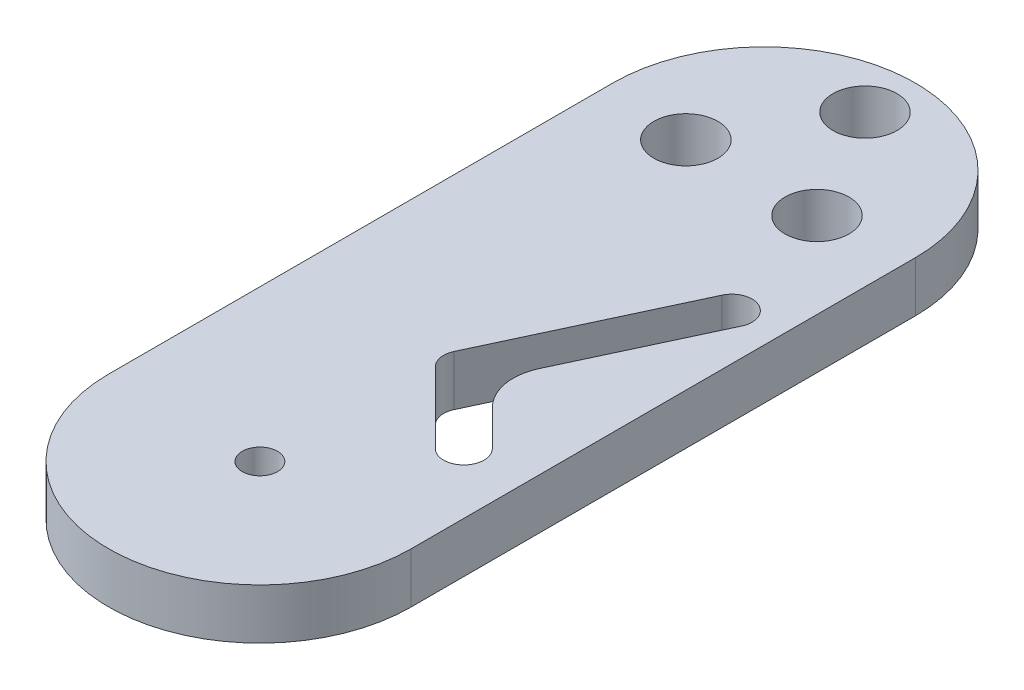
ISO-10303-21;
HEADER;
FILE_DESCRIPTION(('STEP AP214'),'2;1');
FILE_NAME('part.step','',(''),(''),'','','');
FILE_SCHEMA(('AUTOMOTIVE_DESIGN { 1 0 10303 214 1 1 1 1 }'));
ENDSEC;
DATA;
#1=APPLICATION_CONTEXT('core data for automotive mechanical design processes');
#2=APPLICATION_PROTOCOL_DEFINITION('international standard','automotive_design',2000,#1);
#3=PRODUCT_CONTEXT('',#1,'mechanical');
#4=PRODUCT('Part','Part','',(#3));
#5=PRODUCT_RELATED_PRODUCT_CATEGORY('part','',(#4));
#6=PRODUCT_DEFINITION_FORMATION('','',#4);
#7=PRODUCT_DEFINITION_CONTEXT('part definition',#1,'design');
#8=PRODUCT_DEFINITION('design','',#6,#7);
#9=PRODUCT_DEFINITION_SHAPE('','',#8);
#10=(LENGTH_UNIT() NAMED_UNIT(*) SI_UNIT(.MILLI.,.METRE.));
#11=(NAMED_UNIT(*) PLANE_ANGLE_UNIT() SI_UNIT($,.RADIAN.));
#12=(NAMED_UNIT(*) SI_UNIT($,.STERADIAN.) SOLID_ANGLE_UNIT());
#13=UNCERTAINTY_MEASURE_WITH_UNIT(LENGTH_MEASURE(1.E-05),#10,'distance_accuracy_value','');
#14=(GEOMETRIC_REPRESENTATION_CONTEXT(3) GLOBAL_UNCERTAINTY_ASSIGNED_CONTEXT((#13)) GLOBAL_UNIT_ASSIGNED_CONTEXT((#10,
#11,#12)) REPRESENTATION_CONTEXT('',''));
#15=CARTESIAN_POINT('',(0.,0.,0.));
#16=DIRECTION('',(0.,0.,1.));
#17=DIRECTION('',(1.,0.,0.));
#18=AXIS2_PLACEMENT_3D('',#15,#16,#17);
#19=CARTESIAN_POINT('',(15.,5.,0.));
#20=DIRECTION('',(-1.,0.,0.));
#21=DIRECTION('',(0.,0.,1.));
#22=AXIS2_PLACEMENT_3D('',#19,#20,#21);
#23=PLANE('',#22);
#24=DIRECTION('',(0.,0.,-1.));
#25=VECTOR('',#24,1.);
#26=CARTESIAN_POINT('',(15.,0.,0.));
#27=LINE('',#26,#25);
#28=CARTESIAN_POINT('',(15.,0.,0.));
#29=VERTEX_POINT('',#28);
#30=CARTESIAN_POINT('',(15.,0.,-50.));
#31=VERTEX_POINT('',#30);
#32=EDGE_CURVE('E249',#29,#31,#27,.T.);
#33=ORIENTED_EDGE('',*,*,#32,.T.);
#34=DIRECTION('',(0.,-1.,0.));
#35=VECTOR('',#34,1.);
#36=CARTESIAN_POINT('',(15.,5.,-50.));
#37=LINE('',#36,#35);
#38=CARTESIAN_POINT('',(15.,5.,-50.));
#39=VERTEX_POINT('',#38);
#40=EDGE_CURVE('E272',#39,#31,#37,.T.);
#41=ORIENTED_EDGE('',*,*,#40,.F.);
#42=DIRECTION('',(0.,0.,-1.));
#43=VECTOR('',#42,1.);
#44=CARTESIAN_POINT('',(15.,5.,0.));
#45=LINE('',#44,#43);
#46=CARTESIAN_POINT('',(15.,5.,0.));
#47=VERTEX_POINT('',#46);
#48=EDGE_CURVE('E195',#47,#39,#45,.T.);
#49=ORIENTED_EDGE('',*,*,#48,.F.);
#50=DIRECTION('',(0.,-1.,0.));
#51=VECTOR('',#50,1.);
#52=CARTESIAN_POINT('',(15.,5.,0.));
#53=LINE('',#52,#51);
#54=EDGE_CURVE('E143',#47,#29,#53,.T.);
#55=ORIENTED_EDGE('',*,*,#54,.T.);
#56=EDGE_LOOP('',(#33,#41,#49,#55));
#57=FACE_BOUND('',#56,.T.);
#58=ADVANCED_FACE('F41',(#57),#23,.F.);
#59=CARTESIAN_POINT('',(0.,5.,-50.));
#60=DIRECTION('',(0.,-1.,0.));
#61=DIRECTION('',(0.,0.,-1.));
#62=AXIS2_PLACEMENT_3D('',#59,#60,#61);
#63=CYLINDRICAL_SURFACE('',#62,15.);
#64=CARTESIAN_POINT('',(0.,0.,-50.));
#65=DIRECTION('',(0.,1.,0.));
#66=DIRECTION('',(0.,0.,1.));
#67=AXIS2_PLACEMENT_3D('',#64,#65,#66);
#68=CIRCLE('',#67,15.);
#69=CARTESIAN_POINT('',(-15.,0.,-50.));
#70=VERTEX_POINT('',#69);
#71=EDGE_CURVE('E253',#31,#70,#68,.T.);
#72=ORIENTED_EDGE('',*,*,#71,.T.);
#73=DIRECTION('',(0.,-1.,0.));
#74=VECTOR('',#73,1.);
#75=CARTESIAN_POINT('',(-15.,5.,-50.));
#76=LINE('',#75,#74);
#77=CARTESIAN_POINT('',(-15.,5.,-50.));
#78=VERTEX_POINT('',#77);
#79=EDGE_CURVE('E269',#78,#70,#76,.T.);
#80=ORIENTED_EDGE('',*,*,#79,.F.);
#81=CARTESIAN_POINT('',(0.,5.,-50.));
#82=DIRECTION('',(0.,1.,0.));
#83=DIRECTION('',(0.,0.,1.));
#84=AXIS2_PLACEMENT_3D('',#81,#82,#83);
#85=CIRCLE('',#84,15.);
#86=EDGE_CURVE('E199',#39,#78,#85,.T.);
#87=ORIENTED_EDGE('',*,*,#86,.F.);
#88=ORIENTED_EDGE('',*,*,#40,.T.);
#89=EDGE_LOOP('',(#72,#80,#87,#88));
#90=FACE_BOUND('',#89,.T.);
#91=ADVANCED_FACE('F319',(#90),#63,.T.);
#92=CARTESIAN_POINT('',(-15.,5.,0.));
#93=DIRECTION('',(-1.,0.,0.));
#94=DIRECTION('',(0.,0.,1.));
#95=AXIS2_PLACEMENT_3D('',#92,#93,#94);
#96=PLANE('',#95);
#97=DIRECTION('',(0.,0.,-1.));
#98=VECTOR('',#97,1.);
#99=CARTESIAN_POINT('',(-15.,0.,0.));
#100=LINE('',#99,#98);
#101=CARTESIAN_POINT('',(-15.,0.,0.));
#102=VERTEX_POINT('',#101);
#103=EDGE_CURVE('E257',#102,#70,#100,.T.);
#104=ORIENTED_EDGE('',*,*,#103,.F.);
#105=DIRECTION('',(0.,-1.,0.));
#106=VECTOR('',#105,1.);
#107=CARTESIAN_POINT('',(-15.,5.,0.));
#108=LINE('',#107,#106);
#109=CARTESIAN_POINT('',(-15.,5.,0.));
#110=VERTEX_POINT('',#109);
#111=EDGE_CURVE('E266',#110,#102,#108,.T.);
#112=ORIENTED_EDGE('',*,*,#111,.F.);
#113=DIRECTION('',(0.,0.,-1.));
#114=VECTOR('',#113,1.);
#115=CARTESIAN_POINT('',(-15.,5.,0.));
#116=LINE('',#115,#114);
#117=EDGE_CURVE('E202',#110,#78,#116,.T.);
#118=ORIENTED_EDGE('',*,*,#117,.T.);
#119=ORIENTED_EDGE('',*,*,#79,.T.);
#120=EDGE_LOOP('',(#104,#112,#118,#119));
#121=FACE_BOUND('',#120,.T.);
#122=ADVANCED_FACE('F325',(#121),#96,.T.);
#123=CARTESIAN_POINT('',(9.,5.,-11.2213322873401));
#124=DIRECTION('',(0.,-1.,0.));
#125=DIRECTION('',(0.,0.,-1.));
#126=AXIS2_PLACEMENT_3D('',#123,#124,#125);
#127=CYLINDRICAL_SURFACE('',#126,2.);
#128=CARTESIAN_POINT('',(9.,0.,-11.2213322873401));
#129=DIRECTION('',(0.,1.,0.));
#130=DIRECTION('',(0.,0.,1.));
#131=AXIS2_PLACEMENT_3D('',#128,#129,#130);
#132=CIRCLE('',#131,2.);
#133=CARTESIAN_POINT('',(7.58578643762691,0.,-9.80711872496699));
#134=VERTEX_POINT('',#133);
#135=CARTESIAN_POINT('',(10.4142135623731,0.,-12.6355458497132));
#136=VERTEX_POINT('',#135);
#137=EDGE_CURVE('E137',#134,#136,#132,.T.);
#138=ORIENTED_EDGE('',*,*,#137,.F.);
#139=DIRECTION('',(0.,-1.,0.));
#140=VECTOR('',#139,1.);
#141=CARTESIAN_POINT('',(7.58578643762691,5.,-9.80711872496699));
#142=LINE('',#141,#140);
#143=CARTESIAN_POINT('',(7.58578643762691,5.,-9.80711872496699));
#144=VERTEX_POINT('',#143);
#145=EDGE_CURVE('E131',#144,#134,#142,.T.);
#146=ORIENTED_EDGE('',*,*,#145,.F.);
#147=CARTESIAN_POINT('',(9.,5.,-11.2213322873401));
#148=DIRECTION('',(0.,1.,0.));
#149=DIRECTION('',(0.,0.,1.));
#150=AXIS2_PLACEMENT_3D('',#147,#148,#149);
#151=CIRCLE('',#150,2.);
#152=CARTESIAN_POINT('',(10.4142135623731,5.,-12.6355458497132));
#153=VERTEX_POINT('',#152);
#154=EDGE_CURVE('E135',#144,#153,#151,.T.);
#155=ORIENTED_EDGE('',*,*,#154,.T.);
#156=DIRECTION('',(0.,-1.,0.));
#157=VECTOR('',#156,1.);
#158=CARTESIAN_POINT('',(10.4142135623731,5.,-12.6355458497132));
#159=LINE('',#158,#157);
#160=EDGE_CURVE('E209',#153,#136,#159,.T.);
#161=ORIENTED_EDGE('',*,*,#160,.T.);
#162=EDGE_LOOP('',(#138,#146,#155,#161));
#163=FACE_BOUND('',#162,.T.);
#164=ADVANCED_FACE('F133',(#163),#127,.F.);
#165=CARTESIAN_POINT('',(8.69645258129688,5.,-8.69645258129705));
#166=DIRECTION('',(0.707106781186541,0.,-0.707106781186555));
#167=DIRECTION('',(-0.707106781186555,0.,-0.707106781186541));
#168=AXIS2_PLACEMENT_3D('',#165,#166,#167);
#169=PLANE('',#168);
#170=DIRECTION('',(0.707106781186555,0.,0.707106781186541));
#171=VECTOR('',#170,1.);
#172=CARTESIAN_POINT('',(8.69645258129688,0.,-8.69645258129705));
#173=LINE('',#172,#171);
#174=CARTESIAN_POINT('',(0.578536078837901,0.,-16.8143690837559));
#175=VERTEX_POINT('',#174);
#176=EDGE_CURVE('E212',#175,#134,#173,.T.);
#177=ORIENTED_EDGE('',*,*,#176,.F.);
#178=DIRECTION('',(0.,-1.,0.));
#179=VECTOR('',#178,1.);
#180=CARTESIAN_POINT('',(0.578536078837901,5.,-16.8143690837559));
#181=LINE('',#180,#179);
#182=CARTESIAN_POINT('',(0.578536078837901,5.,-16.8143690837559));
#183=VERTEX_POINT('',#182);
#184=EDGE_CURVE('E144',#183,#175,#181,.T.);
#185=ORIENTED_EDGE('',*,*,#184,.F.);
#186=DIRECTION('',(0.707106781186555,0.,0.707106781186541));
#187=VECTOR('',#186,1.);
#188=CARTESIAN_POINT('',(8.69645258129688,5.,-8.69645258129705));
#189=LINE('',#188,#187);
#190=EDGE_CURVE('E151',#183,#144,#189,.T.);
#191=ORIENTED_EDGE('',*,*,#190,.T.);
#192=ORIENTED_EDGE('',*,*,#145,.T.);
#193=EDGE_LOOP('',(#177,#185,#191,#192));
#194=FACE_BOUND('',#193,.T.);
#195=ADVANCED_FACE('F159',(#194),#169,.T.);
#196=CARTESIAN_POINT('',(1.99274964121098,5.,-18.228582646129));
#197=DIRECTION('',(0.,-1.,0.));
#198=DIRECTION('',(0.,0.,-1.));
#199=AXIS2_PLACEMENT_3D('',#196,#197,#198);
#200=CYLINDRICAL_SURFACE('',#199,2.);
#201=CARTESIAN_POINT('',(1.99274964121098,0.,-18.228582646129));
#202=DIRECTION('',(0.,1.,0.));
#203=DIRECTION('',(0.,0.,1.));
#204=AXIS2_PLACEMENT_3D('',#201,#202,#203);
#205=CIRCLE('',#204,2.);
#206=CARTESIAN_POINT('',(0.180134067137676,0.,-19.0738191696104));
#207=VERTEX_POINT('',#206);
#208=EDGE_CURVE('E215',#207,#175,#205,.T.);
#209=ORIENTED_EDGE('',*,*,#208,.F.);
#210=DIRECTION('',(0.,-1.,0.));
#211=VECTOR('',#210,1.);
#212=CARTESIAN_POINT('',(0.180134067137676,5.,-19.0738191696104));
#213=LINE('',#212,#211);
#214=CARTESIAN_POINT('',(0.180134067137676,5.,-19.0738191696104));
#215=VERTEX_POINT('',#214);
#216=EDGE_CURVE('E285',#215,#207,#213,.T.);
#217=ORIENTED_EDGE('',*,*,#216,.F.);
#218=CARTESIAN_POINT('',(1.99274964121098,5.,-18.228582646129));
#219=DIRECTION('',(0.,1.,0.));
#220=DIRECTION('',(0.,0.,1.));
#221=AXIS2_PLACEMENT_3D('',#218,#219,#220);
#222=CIRCLE('',#221,2.);
#223=EDGE_CURVE('E161',#215,#183,#222,.T.);
#224=ORIENTED_EDGE('',*,*,#223,.T.);
#225=ORIENTED_EDGE('',*,*,#184,.T.);
#226=EDGE_LOOP('',(#209,#217,#224,#225));
#227=FACE_BOUND('',#226,.T.);
#228=ADVANCED_FACE('F305',(#227),#200,.F.);
#229=CARTESIAN_POINT('',(-7.15773558517994,5.,-3.3377069184179));
#230=DIRECTION('',(0.906307787036653,0.,0.422618261740694));
#231=DIRECTION('',(0.422618261740694,0.,-0.906307787036653));
#232=AXIS2_PLACEMENT_3D('',#229,#230,#231);
#233=PLANE('',#232);
#234=DIRECTION('',(-0.422618261740694,0.,0.906307787036653));
#235=VECTOR('',#234,1.);
#236=CARTESIAN_POINT('',(-7.15773558517994,0.,-3.3377069184179));
#237=LINE('',#236,#235);
#238=CARTESIAN_POINT('',(8.63249930195154,0.,-37.1999749103434));
#239=VERTEX_POINT('',#238);
#240=EDGE_CURVE('E219',#239,#207,#237,.T.);
#241=ORIENTED_EDGE('',*,*,#240,.F.);
#242=DIRECTION('',(0.,-1.,0.));
#243=VECTOR('',#242,1.);
#244=CARTESIAN_POINT('',(8.63249930195154,5.,-37.1999749103434));
#245=LINE('',#244,#243);
#246=CARTESIAN_POINT('',(8.63249930195154,5.,-37.1999749103434));
#247=VERTEX_POINT('',#246);
#248=EDGE_CURVE('E282',#247,#239,#245,.T.);
#249=ORIENTED_EDGE('',*,*,#248,.F.);
#250=DIRECTION('',(-0.422618261740694,0.,0.906307787036653));
#251=VECTOR('',#250,1.);
#252=CARTESIAN_POINT('',(-7.15773558517994,5.,-3.3377069184179));
#253=LINE('',#252,#251);
#254=EDGE_CURVE('E164',#247,#215,#253,.T.);
#255=ORIENTED_EDGE('',*,*,#254,.T.);
#256=ORIENTED_EDGE('',*,*,#216,.T.);
#257=EDGE_LOOP('',(#241,#249,#255,#256));
#258=FACE_BOUND('',#257,.T.);
#259=ADVANCED_FACE('F309',(#258),#233,.T.);
#260=CARTESIAN_POINT('',(10.4451148760249,5.,-36.354738386862));
#261=DIRECTION('',(0.,-1.,0.));
#262=DIRECTION('',(0.,0.,-1.));
#263=AXIS2_PLACEMENT_3D('',#260,#261,#262);
#264=CYLINDRICAL_SURFACE('',#263,2.);
#265=CARTESIAN_POINT('',(10.4451148760249,0.,-36.354738386862));
#266=DIRECTION('',(0.,1.,0.));
#267=DIRECTION('',(0.,0.,1.));
#268=AXIS2_PLACEMENT_3D('',#265,#266,#267);
#269=CIRCLE('',#268,2.);
#270=CARTESIAN_POINT('',(12.2577304500982,0.,-35.5095018633806));
#271=VERTEX_POINT('',#270);
#272=EDGE_CURVE('E223',#271,#239,#269,.T.);
#273=ORIENTED_EDGE('',*,*,#272,.F.);
#274=DIRECTION('',(0.,-1.,0.));
#275=VECTOR('',#274,1.);
#276=CARTESIAN_POINT('',(12.2577304500982,5.,-35.5095018633806));
#277=LINE('',#276,#275);
#278=CARTESIAN_POINT('',(12.2577304500982,5.,-35.5095018633806));
#279=VERTEX_POINT('',#278);
#280=EDGE_CURVE('E279',#279,#271,#277,.T.);
#281=ORIENTED_EDGE('',*,*,#280,.F.);
#282=CARTESIAN_POINT('',(10.4451148760249,5.,-36.354738386862));
#283=DIRECTION('',(0.,1.,0.));
#284=DIRECTION('',(0.,0.,1.));
#285=AXIS2_PLACEMENT_3D('',#282,#283,#284);
#286=CIRCLE('',#285,2.);
#287=EDGE_CURVE('E170',#279,#247,#286,.T.);
#288=ORIENTED_EDGE('',*,*,#287,.T.);
#289=ORIENTED_EDGE('',*,*,#248,.T.);
#290=EDGE_LOOP('',(#273,#281,#288,#289));
#291=FACE_BOUND('',#290,.T.);
#292=ADVANCED_FACE('F312',(#291),#264,.F.);
#293=CARTESIAN_POINT('',(-3.53250443703333,5.,-1.64723387145512));
#294=DIRECTION('',(0.906307787036653,0.,0.422618261740694));
#295=DIRECTION('',(0.422618261740694,0.,-0.906307787036653));
#296=AXIS2_PLACEMENT_3D('',#293,#294,#295);
#297=PLANE('',#296);
#298=DIRECTION('',(-0.422618261740694,0.,0.906307787036653));
#299=VECTOR('',#298,1.);
#300=CARTESIAN_POINT('',(-3.53250443703333,0.,-1.64723387145512));
#301=LINE('',#300,#299);
#302=CARTESIAN_POINT('',(5.87680866387572,0.,-21.8255709335962));
#303=VERTEX_POINT('',#302);
#304=EDGE_CURVE('E227',#271,#303,#301,.T.);
#305=ORIENTED_EDGE('',*,*,#304,.T.);
#306=DIRECTION('',(0.,-1.,0.));
#307=VECTOR('',#306,1.);
#308=CARTESIAN_POINT('',(5.87680866387572,5.,-21.8255709335962));
#309=LINE('',#308,#307);
#310=CARTESIAN_POINT('',(5.87680866387572,5.,-21.8255709335962));
#311=VERTEX_POINT('',#310);
#312=EDGE_CURVE('E50',#303,#311,#309,.F.);
#313=ORIENTED_EDGE('',*,*,#312,.T.);
#314=DIRECTION('',(-0.422618261740694,0.,0.906307787036653));
#315=VECTOR('',#314,1.);
#316=CARTESIAN_POINT('',(-3.53250443703333,5.,-1.64723387145512));
#317=LINE('',#316,#315);
#318=EDGE_CURVE('E174',#279,#311,#317,.T.);
#319=ORIENTED_EDGE('',*,*,#318,.F.);
#320=ORIENTED_EDGE('',*,*,#280,.T.);
#321=EDGE_LOOP('',(#305,#313,#319,#320));
#322=FACE_BOUND('',#321,.T.);
#323=ADVANCED_FACE('F334',(#322),#297,.F.);
#324=CARTESIAN_POINT('',(0.,5.,0.));
#325=DIRECTION('',(0.,-1.,0.));
#326=DIRECTION('',(0.,0.,-1.));
#327=AXIS2_PLACEMENT_3D('',#324,#325,#326);
#328=CYLINDRICAL_SURFACE('',#327,1.75);
#329=CARTESIAN_POINT('',(0.,5.,0.));
#330=DIRECTION('',(0.,1.,0.));
#331=DIRECTION('',(0.,0.,1.));
#332=AXIS2_PLACEMENT_3D('',#329,#330,#331);
#333=CIRCLE('',#332,1.75);
#334=CARTESIAN_POINT('',(0.,5.,1.75));
#335=VERTEX_POINT('',#334);
#336=EDGE_CURVE('E191',#335,#335,#333,.T.);
#337=ORIENTED_EDGE('',*,*,#336,.T.);
#338=EDGE_LOOP('',(#337));
#339=FACE_BOUND('',#338,.T.);
#340=CARTESIAN_POINT('',(0.,0.,0.));
#341=DIRECTION('',(0.,1.,0.));
#342=DIRECTION('',(0.,0.,1.));
#343=AXIS2_PLACEMENT_3D('',#340,#341,#342);
#344=CIRCLE('',#343,1.75);
#345=CARTESIAN_POINT('',(0.,0.,1.75));
#346=VERTEX_POINT('',#345);
#347=EDGE_CURVE('E245',#346,#346,#344,.T.);
#348=ORIENTED_EDGE('',*,*,#347,.F.);
#349=EDGE_LOOP('',(#348));
#350=FACE_BOUND('',#349,.T.);
#351=ADVANCED_FACE('F330',(#339,#350),#328,.F.);
#352=CARTESIAN_POINT('',(0.,5.,-60.));
#353=DIRECTION('',(0.,-1.,0.));
#354=DIRECTION('',(0.,0.,-1.));
#355=AXIS2_PLACEMENT_3D('',#352,#353,#354);
#356=CYLINDRICAL_SURFACE('',#355,3.175);
#357=CARTESIAN_POINT('',(0.,5.,-60.));
#358=DIRECTION('',(0.,1.,0.));
#359=DIRECTION('',(0.,0.,1.));
#360=AXIS2_PLACEMENT_3D('',#357,#358,#359);
#361=CIRCLE('',#360,3.175);
#362=CARTESIAN_POINT('',(0.,5.,-56.825));
#363=VERTEX_POINT('',#362);
#364=EDGE_CURVE('E187',#363,#363,#361,.T.);
#365=ORIENTED_EDGE('',*,*,#364,.T.);
#366=EDGE_LOOP('',(#365));
#367=FACE_BOUND('',#366,.T.);
#368=CARTESIAN_POINT('',(0.,0.,-60.));
#369=DIRECTION('',(0.,1.,0.));
#370=DIRECTION('',(0.,0.,1.));
#371=AXIS2_PLACEMENT_3D('',#368,#369,#370);
#372=CIRCLE('',#371,3.175);
#373=CARTESIAN_POINT('',(0.,0.,-56.825));
#374=VERTEX_POINT('',#373);
#375=EDGE_CURVE('E241',#374,#374,#372,.T.);
#376=ORIENTED_EDGE('',*,*,#375,.F.);
#377=EDGE_LOOP('',(#376));
#378=FACE_BOUND('',#377,.T.);
#379=ADVANCED_FACE('F333',(#367,#378),#356,.F.);
#380=CARTESIAN_POINT('',(-6.5,5.,-48.7416697508023));
#381=DIRECTION('',(0.,-1.,0.));
#382=DIRECTION('',(0.,0.,-1.));
#383=AXIS2_PLACEMENT_3D('',#380,#381,#382);
#384=CYLINDRICAL_SURFACE('',#383,3.175);
#385=CARTESIAN_POINT('',(-6.5,5.,-48.7416697508023));
#386=DIRECTION('',(0.,1.,0.));
#387=DIRECTION('',(0.,0.,1.));
#388=AXIS2_PLACEMENT_3D('',#385,#386,#387);
#389=CIRCLE('',#388,3.175);
#390=CARTESIAN_POINT('',(-6.5,5.,-45.5666697508023));
#391=VERTEX_POINT('',#390);
#392=EDGE_CURVE('E183',#391,#391,#389,.T.);
#393=ORIENTED_EDGE('',*,*,#392,.T.);
#394=EDGE_LOOP('',(#393));
#395=FACE_BOUND('',#394,.T.);
#396=CARTESIAN_POINT('',(-6.5,0.,-48.7416697508023));
#397=DIRECTION('',(0.,1.,0.));
#398=DIRECTION('',(0.,0.,1.));
#399=AXIS2_PLACEMENT_3D('',#396,#397,#398);
#400=CIRCLE('',#399,3.175);
#401=CARTESIAN_POINT('',(-6.5,0.,-45.5666697508023));
#402=VERTEX_POINT('',#401);
#403=EDGE_CURVE('E237',#402,#402,#400,.T.);
#404=ORIENTED_EDGE('',*,*,#403,.F.);
#405=EDGE_LOOP('',(#404));
#406=FACE_BOUND('',#405,.T.);
#407=ADVANCED_FACE('F338',(#395,#406),#384,.F.);
#408=CARTESIAN_POINT('',(6.5,5.,-48.7416697508023));
#409=DIRECTION('',(0.,-1.,0.));
#410=DIRECTION('',(0.,0.,-1.));
#411=AXIS2_PLACEMENT_3D('',#408,#409,#410);
#412=CYLINDRICAL_SURFACE('',#411,3.175);
#413=CARTESIAN_POINT('',(6.5,5.,-48.7416697508023));
#414=DIRECTION('',(0.,1.,0.));
#415=DIRECTION('',(0.,0.,1.));
#416=AXIS2_PLACEMENT_3D('',#413,#414,#415);
#417=CIRCLE('',#416,3.175);
#418=CARTESIAN_POINT('',(6.5,5.,-45.5666697508023));
#419=VERTEX_POINT('',#418);
#420=EDGE_CURVE('E179',#419,#419,#417,.T.);
#421=ORIENTED_EDGE('',*,*,#420,.T.);
#422=EDGE_LOOP('',(#421));
#423=FACE_BOUND('',#422,.T.);
#424=CARTESIAN_POINT('',(6.5,0.,-48.7416697508023));
#425=DIRECTION('',(0.,1.,0.));
#426=DIRECTION('',(0.,0.,1.));
#427=AXIS2_PLACEMENT_3D('',#424,#425,#426);
#428=CIRCLE('',#427,3.175);
#429=CARTESIAN_POINT('',(6.5,0.,-45.5666697508023));
#430=VERTEX_POINT('',#429);
#431=EDGE_CURVE('E233',#430,#430,#428,.T.);
#432=ORIENTED_EDGE('',*,*,#431,.F.);
#433=EDGE_LOOP('',(#432));
#434=FACE_BOUND('',#433,.T.);
#435=ADVANCED_FACE('F342',(#423,#434),#412,.F.);
#436=CARTESIAN_POINT('',(11.524879706043,5.,-11.5248797060433));
#437=DIRECTION('',(0.707106781186541,0.,-0.707106781186554));
#438=DIRECTION('',(-0.707106781186554,0.,-0.707106781186541));
#439=AXIS2_PLACEMENT_3D('',#436,#437,#438);
#440=PLANE('',#439);
#441=DIRECTION('',(0.707106781186554,0.,0.707106781186541));
#442=VECTOR('',#441,1.);
#443=CARTESIAN_POINT('',(11.524879706043,5.,-11.5248797060433));
#444=LINE('',#443,#442);
#445=CARTESIAN_POINT('',(6.87281369312628,5.,-16.1769457189599));
#446=VERTEX_POINT('',#445);
#447=EDGE_CURVE('E154',#446,#153,#444,.T.);
#448=ORIENTED_EDGE('',*,*,#447,.F.);
#449=DIRECTION('',(0.,-1.,0.));
#450=VECTOR('',#449,1.);
#451=CARTESIAN_POINT('',(6.87281369312628,5.,-16.1769457189599));
#452=LINE('',#451,#450);
#453=CARTESIAN_POINT('',(6.87281369312628,0.,-16.1769457189599));
#454=VERTEX_POINT('',#453);
#455=EDGE_CURVE('E276',#446,#454,#452,.T.);
#456=ORIENTED_EDGE('',*,*,#455,.T.);
#457=DIRECTION('',(0.707106781186554,0.,0.707106781186541));
#458=VECTOR('',#457,1.);
#459=CARTESIAN_POINT('',(11.524879706043,0.,-11.5248797060433));
#460=LINE('',#459,#458);
#461=EDGE_CURVE('E230',#454,#136,#460,.T.);
#462=ORIENTED_EDGE('',*,*,#461,.T.);
#463=ORIENTED_EDGE('',*,*,#160,.F.);
#464=EDGE_LOOP('',(#448,#456,#462,#463));
#465=FACE_BOUND('',#464,.T.);
#466=ADVANCED_FACE('F297',(#465),#440,.F.);
#467=CARTESIAN_POINT('',(0.,5.,0.));
#468=DIRECTION('',(0.,-1.,0.));
#469=DIRECTION('',(0.,0.,-1.));
#470=AXIS2_PLACEMENT_3D('',#467,#468,#469);
#471=CYLINDRICAL_SURFACE('',#470,15.);
#472=CARTESIAN_POINT('',(0.,0.,0.));
#473=DIRECTION('',(0.,1.,0.));
#474=DIRECTION('',(0.,0.,1.));
#475=AXIS2_PLACEMENT_3D('',#472,#473,#474);
#476=CIRCLE('',#475,15.);
#477=EDGE_CURVE('E157',#102,#29,#476,.T.);
#478=ORIENTED_EDGE('',*,*,#477,.T.);
#479=ORIENTED_EDGE('',*,*,#54,.F.);
#480=CARTESIAN_POINT('',(0.,5.,0.));
#481=DIRECTION('',(0.,1.,0.));
#482=DIRECTION('',(0.,0.,1.));
#483=AXIS2_PLACEMENT_3D('',#480,#481,#482);
#484=CIRCLE('',#483,15.);
#485=EDGE_CURVE('E206',#110,#47,#484,.T.);
#486=ORIENTED_EDGE('',*,*,#485,.F.);
#487=ORIENTED_EDGE('',*,*,#111,.T.);
#488=EDGE_LOOP('',(#478,#479,#486,#487));
#489=FACE_BOUND('',#488,.T.);
#490=ADVANCED_FACE('F349',(#489),#471,.T.);
#491=CARTESIAN_POINT('',(0.,5.,0.));
#492=DIRECTION('',(0.,1.,0.));
#493=DIRECTION('',(0.,0.,1.));
#494=AXIS2_PLACEMENT_3D('',#491,#492,#493);
#495=PLANE('',#494);
#496=ORIENTED_EDGE('',*,*,#318,.T.);
#497=CARTESIAN_POINT('',(10.408347599059,5.,-19.7124796248927));
#498=DIRECTION('',(0.,1.,0.));
#499=DIRECTION('',(0.,0.,1.));
#500=AXIS2_PLACEMENT_3D('',#497,#498,#499);
#501=CIRCLE('',#500,5.);
#502=EDGE_CURVE('E11',#311,#446,#501,.T.);
#503=ORIENTED_EDGE('',*,*,#502,.T.);
#504=ORIENTED_EDGE('',*,*,#447,.T.);
#505=ORIENTED_EDGE('',*,*,#154,.F.);
#506=ORIENTED_EDGE('',*,*,#190,.F.);
#507=ORIENTED_EDGE('',*,*,#223,.F.);
#508=ORIENTED_EDGE('',*,*,#254,.F.);
#509=ORIENTED_EDGE('',*,*,#287,.F.);
#510=EDGE_LOOP('',(#496,#503,#504,#505,#506,#507,#508,#509));
#511=FACE_BOUND('',#510,.T.);
#512=ORIENTED_EDGE('',*,*,#420,.F.);
#513=EDGE_LOOP('',(#512));
#514=FACE_BOUND('',#513,.T.);
#515=ORIENTED_EDGE('',*,*,#392,.F.);
#516=EDGE_LOOP('',(#515));
#517=FACE_BOUND('',#516,.T.);
#518=ORIENTED_EDGE('',*,*,#364,.F.);
#519=EDGE_LOOP('',(#518));
#520=FACE_BOUND('',#519,.T.);
#521=ORIENTED_EDGE('',*,*,#336,.F.);
#522=EDGE_LOOP('',(#521));
#523=FACE_BOUND('',#522,.T.);
#524=ORIENTED_EDGE('',*,*,#48,.T.);
#525=ORIENTED_EDGE('',*,*,#86,.T.);
#526=ORIENTED_EDGE('',*,*,#117,.F.);
#527=ORIENTED_EDGE('',*,*,#485,.T.);
#528=EDGE_LOOP('',(#524,#525,#526,#527));
#529=FACE_BOUND('',#528,.T.);
#530=ADVANCED_FACE('F148',(#511,#514,#517,#520,#523,#529),#495,.T.);
#531=CARTESIAN_POINT('',(0.,0.,0.));
#532=DIRECTION('',(0.,1.,0.));
#533=DIRECTION('',(0.,0.,1.));
#534=AXIS2_PLACEMENT_3D('',#531,#532,#533);
#535=PLANE('',#534);
#536=ORIENTED_EDGE('',*,*,#461,.F.);
#537=CARTESIAN_POINT('',(10.408347599059,0.,-19.7124796248927));
#538=DIRECTION('',(0.,1.,0.));
#539=DIRECTION('',(0.,0.,1.));
#540=AXIS2_PLACEMENT_3D('',#537,#538,#539);
#541=CIRCLE('',#540,5.);
#542=EDGE_CURVE('E64',#454,#303,#541,.F.);
#543=ORIENTED_EDGE('',*,*,#542,.T.);
#544=ORIENTED_EDGE('',*,*,#304,.F.);
#545=ORIENTED_EDGE('',*,*,#272,.T.);
#546=ORIENTED_EDGE('',*,*,#240,.T.);
#547=ORIENTED_EDGE('',*,*,#208,.T.);
#548=ORIENTED_EDGE('',*,*,#176,.T.);
#549=ORIENTED_EDGE('',*,*,#137,.T.);
#550=EDGE_LOOP('',(#536,#543,#544,#545,#546,#547,#548,#549));
#551=FACE_BOUND('',#550,.T.);
#552=ORIENTED_EDGE('',*,*,#431,.T.);
#553=EDGE_LOOP('',(#552));
#554=FACE_BOUND('',#553,.T.);
#555=ORIENTED_EDGE('',*,*,#403,.T.);
#556=EDGE_LOOP('',(#555));
#557=FACE_BOUND('',#556,.T.);
#558=ORIENTED_EDGE('',*,*,#375,.T.);
#559=EDGE_LOOP('',(#558));
#560=FACE_BOUND('',#559,.T.);
#561=ORIENTED_EDGE('',*,*,#347,.T.);
#562=EDGE_LOOP('',(#561));
#563=FACE_BOUND('',#562,.T.);
#564=ORIENTED_EDGE('',*,*,#32,.F.);
#565=ORIENTED_EDGE('',*,*,#477,.F.);
#566=ORIENTED_EDGE('',*,*,#103,.T.);
#567=ORIENTED_EDGE('',*,*,#71,.F.);
#568=EDGE_LOOP('',(#564,#565,#566,#567));
#569=FACE_BOUND('',#568,.T.);
#570=ADVANCED_FACE('F300',(#551,#554,#557,#560,#563,#569),#535,.F.);
#571=CARTESIAN_POINT('',(10.408347599059,5.,-19.7124796248927));
#572=DIRECTION('',(0.,-1.,0.));
#573=DIRECTION('',(0.,0.,-1.));
#574=AXIS2_PLACEMENT_3D('',#571,#572,#573);
#575=CYLINDRICAL_SURFACE('',#574,5.);
#576=ORIENTED_EDGE('',*,*,#502,.F.);
#577=ORIENTED_EDGE('',*,*,#312,.F.);
#578=ORIENTED_EDGE('',*,*,#542,.F.);
#579=ORIENTED_EDGE('',*,*,#455,.F.);
#580=EDGE_LOOP('',(#576,#577,#578,#579));
#581=FACE_BOUND('',#580,.T.);
#582=ADVANCED_FACE('F43',(#581),#575,.T.);
#583=CLOSED_SHELL('',(#58,#91,#122,#164,#195,#228,#259,#292,#323,#351,#379,#407,#435,#466,#490,
#530,#570,#582));
#584=MANIFOLD_SOLID_BREP('B2',#583);
#585=ADVANCED_BREP_SHAPE_REPRESENTATION('',(#18,#584),#14);
#586=SHAPE_DEFINITION_REPRESENTATION(#9,#585);
ENDSEC;
END-ISO-10303-21;
